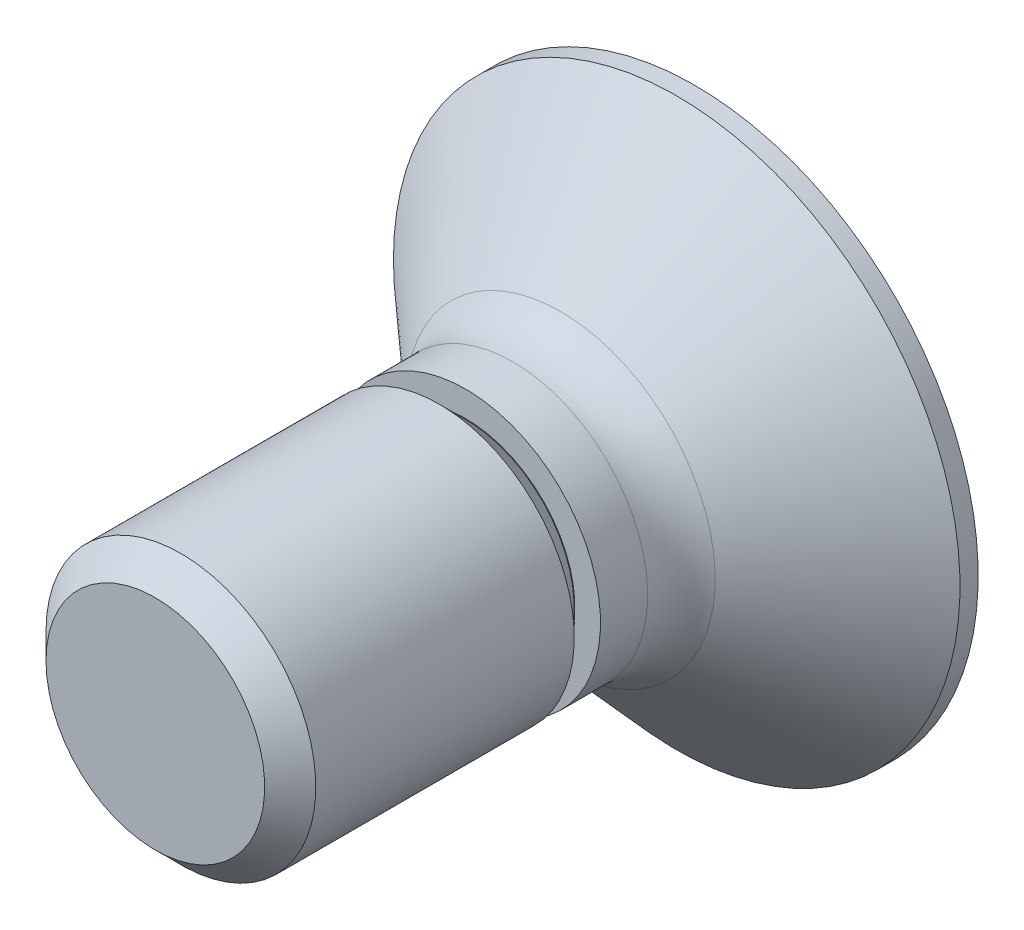
ISO-10303-21;
HEADER;
FILE_DESCRIPTION(('STEP AP214'),'2;1');
FILE_NAME('part.step','',(''),(''),'','','');
FILE_SCHEMA(('AUTOMOTIVE_DESIGN { 1 0 10303 214 1 1 1 1 }'));
ENDSEC;
DATA;
#1=APPLICATION_CONTEXT('core data for automotive mechanical design processes');
#2=APPLICATION_PROTOCOL_DEFINITION('international standard','automotive_design',2000,#1);
#3=PRODUCT_CONTEXT('',#1,'mechanical');
#4=PRODUCT('Part','Part','',(#3));
#5=PRODUCT_RELATED_PRODUCT_CATEGORY('part','',(#4));
#6=PRODUCT_DEFINITION_FORMATION('','',#4);
#7=PRODUCT_DEFINITION_CONTEXT('part definition',#1,'design');
#8=PRODUCT_DEFINITION('design','',#6,#7);
#9=PRODUCT_DEFINITION_SHAPE('','',#8);
#10=(LENGTH_UNIT() NAMED_UNIT(*) SI_UNIT(.MILLI.,.METRE.));
#11=(NAMED_UNIT(*) PLANE_ANGLE_UNIT() SI_UNIT($,.RADIAN.));
#12=(NAMED_UNIT(*) SI_UNIT($,.STERADIAN.) SOLID_ANGLE_UNIT());
#13=UNCERTAINTY_MEASURE_WITH_UNIT(LENGTH_MEASURE(1.E-05),#10,'distance_accuracy_value','');
#14=(GEOMETRIC_REPRESENTATION_CONTEXT(3) GLOBAL_UNCERTAINTY_ASSIGNED_CONTEXT((#13)) GLOBAL_UNIT_ASSIGNED_CONTEXT((#10,
#11,#12)) REPRESENTATION_CONTEXT('',''));
#15=CARTESIAN_POINT('',(0.,0.,0.));
#16=DIRECTION('',(0.,0.,1.));
#17=DIRECTION('',(1.,0.,0.));
#18=AXIS2_PLACEMENT_3D('',#15,#16,#17);
#19=CARTESIAN_POINT('',(0.,4.2,0.));
#20=DIRECTION('',(0.,0.,1.));
#21=DIRECTION('',(1.,0.,0.));
#22=AXIS2_PLACEMENT_3D('',#19,#20,#21);
#23=PLANE('',#22);
#24=CARTESIAN_POINT('',(0.,0.,0.));
#25=DIRECTION('',(0.,0.,-1.));
#26=DIRECTION('',(-1.,0.,0.));
#27=AXIS2_PLACEMENT_3D('',#24,#25,#26);
#28=CIRCLE('',#27,4.2);
#29=CARTESIAN_POINT('',(-4.2,0.,0.));
#30=VERTEX_POINT('',#29);
#31=EDGE_CURVE('E210',#30,#30,#28,.T.);
#32=ORIENTED_EDGE('',*,*,#31,.T.);
#33=EDGE_LOOP('',(#32));
#34=FACE_BOUND('',#33,.T.);
#35=DIRECTION('',(0.422618261740699,0.90630778703665,0.));
#36=VECTOR('',#35,1.);
#37=CARTESIAN_POINT('',(0.383333333333334,-2.3,0.));
#38=LINE('',#37,#36);
#39=CARTESIAN_POINT('',(0.383333333333334,-2.3,0.));
#40=VERTEX_POINT('',#39);
#41=CARTESIAN_POINT('',(0.992861858828223,-0.992861858828222,0.));
#42=VERTEX_POINT('',#41);
#43=EDGE_CURVE('E32',#40,#42,#38,.T.);
#44=ORIENTED_EDGE('',*,*,#43,.T.);
#45=DIRECTION('',(0.90630778703665,0.422618261740699,0.));
#46=VECTOR('',#45,1.);
#47=CARTESIAN_POINT('',(0.992861858828223,-0.992861858828222,0.));
#48=LINE('',#47,#46);
#49=CARTESIAN_POINT('',(2.3,-0.383333333333334,0.));
#50=VERTEX_POINT('',#49);
#51=EDGE_CURVE('E87',#42,#50,#48,.T.);
#52=ORIENTED_EDGE('',*,*,#51,.T.);
#53=DIRECTION('',(0.,1.,0.));
#54=VECTOR('',#53,1.);
#55=CARTESIAN_POINT('',(2.3,-0.383333333333334,0.));
#56=LINE('',#55,#54);
#57=CARTESIAN_POINT('',(2.3,0.383333333333334,0.));
#58=VERTEX_POINT('',#57);
#59=EDGE_CURVE('E171',#50,#58,#56,.T.);
#60=ORIENTED_EDGE('',*,*,#59,.T.);
#61=DIRECTION('',(-0.90630778703665,0.422618261740699,0.));
#62=VECTOR('',#61,1.);
#63=CARTESIAN_POINT('',(2.3,0.383333333333334,0.));
#64=LINE('',#63,#62);
#65=CARTESIAN_POINT('',(0.992861858828224,0.992861858828222,0.));
#66=VERTEX_POINT('',#65);
#67=EDGE_CURVE('E167',#58,#66,#64,.T.);
#68=ORIENTED_EDGE('',*,*,#67,.T.);
#69=DIRECTION('',(-0.4226182617407,0.90630778703665,0.));
#70=VECTOR('',#69,1.);
#71=CARTESIAN_POINT('',(0.992861858828224,0.992861858828222,0.));
#72=LINE('',#71,#70);
#73=CARTESIAN_POINT('',(0.383333333333334,2.3,0.));
#74=VERTEX_POINT('',#73);
#75=EDGE_CURVE('E163',#66,#74,#72,.T.);
#76=ORIENTED_EDGE('',*,*,#75,.T.);
#77=DIRECTION('',(-1.,0.,0.));
#78=VECTOR('',#77,1.);
#79=CARTESIAN_POINT('',(0.383333333333334,2.3,0.));
#80=LINE('',#79,#78);
#81=CARTESIAN_POINT('',(-0.383333333333333,2.3,0.));
#82=VERTEX_POINT('',#81);
#83=EDGE_CURVE('E159',#74,#82,#80,.T.);
#84=ORIENTED_EDGE('',*,*,#83,.T.);
#85=DIRECTION('',(-0.422618261740699,-0.90630778703665,0.));
#86=VECTOR('',#85,1.);
#87=CARTESIAN_POINT('',(-0.383333333333333,2.3,0.));
#88=LINE('',#87,#86);
#89=CARTESIAN_POINT('',(-0.992861858828222,0.992861858828223,0.));
#90=VERTEX_POINT('',#89);
#91=EDGE_CURVE('E155',#82,#90,#88,.T.);
#92=ORIENTED_EDGE('',*,*,#91,.T.);
#93=DIRECTION('',(-0.90630778703665,-0.422618261740699,0.));
#94=VECTOR('',#93,1.);
#95=CARTESIAN_POINT('',(-0.992861858828222,0.992861858828223,0.));
#96=LINE('',#95,#94);
#97=CARTESIAN_POINT('',(-2.3,0.383333333333334,0.));
#98=VERTEX_POINT('',#97);
#99=EDGE_CURVE('E151',#90,#98,#96,.T.);
#100=ORIENTED_EDGE('',*,*,#99,.T.);
#101=DIRECTION('',(0.,-1.,0.));
#102=VECTOR('',#101,1.);
#103=CARTESIAN_POINT('',(-2.3,0.383333333333334,0.));
#104=LINE('',#103,#102);
#105=CARTESIAN_POINT('',(-2.3,-0.383333333333333,0.));
#106=VERTEX_POINT('',#105);
#107=EDGE_CURVE('E146',#98,#106,#104,.T.);
#108=ORIENTED_EDGE('',*,*,#107,.T.);
#109=DIRECTION('',(0.90630778703665,-0.422618261740699,0.));
#110=VECTOR('',#109,1.);
#111=CARTESIAN_POINT('',(-2.3,-0.383333333333333,0.));
#112=LINE('',#111,#110);
#113=CARTESIAN_POINT('',(-0.992861858828224,-0.992861858828222,0.));
#114=VERTEX_POINT('',#113);
#115=EDGE_CURVE('E137',#106,#114,#112,.T.);
#116=ORIENTED_EDGE('',*,*,#115,.T.);
#117=DIRECTION('',(0.422618261740699,-0.90630778703665,0.));
#118=VECTOR('',#117,1.);
#119=CARTESIAN_POINT('',(-0.992861858828224,-0.992861858828222,0.));
#120=LINE('',#119,#118);
#121=CARTESIAN_POINT('',(-0.383333333333334,-2.3,0.));
#122=VERTEX_POINT('',#121);
#123=EDGE_CURVE('E120',#114,#122,#120,.T.);
#124=ORIENTED_EDGE('',*,*,#123,.T.);
#125=DIRECTION('',(1.,0.,0.));
#126=VECTOR('',#125,1.);
#127=CARTESIAN_POINT('',(-0.383333333333334,-2.3,0.));
#128=LINE('',#127,#126);
#129=EDGE_CURVE('E129',#122,#40,#128,.T.);
#130=ORIENTED_EDGE('',*,*,#129,.T.);
#131=EDGE_LOOP('',(#44,#52,#60,#68,#76,#84,#92,#100,#108,#116,#124,#130));
#132=FACE_BOUND('',#131,.T.);
#133=ADVANCED_FACE('F16',(#34,#132),#23,.F.);
#134=CARTESIAN_POINT('',(0.,0.,8.));
#135=DIRECTION('',(0.,0.,-1.));
#136=DIRECTION('',(-1.,0.,0.));
#137=AXIS2_PLACEMENT_3D('',#134,#135,#136);
#138=PLANE('',#137);
#139=CARTESIAN_POINT('',(0.,0.,8.));
#140=DIRECTION('',(0.,0.,-1.));
#141=DIRECTION('',(-1.,0.,0.));
#142=AXIS2_PLACEMENT_3D('',#139,#140,#141);
#143=CIRCLE('',#142,1.621125);
#144=CARTESIAN_POINT('',(-1.621125,0.,8.));
#145=VERTEX_POINT('',#144);
#146=EDGE_CURVE('E10',#145,#145,#143,.T.);
#147=ORIENTED_EDGE('',*,*,#146,.F.);
#148=EDGE_LOOP('',(#147));
#149=FACE_BOUND('',#148,.T.);
#150=ADVANCED_FACE('F18',(#149),#138,.F.);
#151=CARTESIAN_POINT('',(0.,0.,8.));
#152=DIRECTION('',(0.,0.,-1.));
#153=DIRECTION('',(-1.,0.,0.));
#154=AXIS2_PLACEMENT_3D('',#151,#152,#153);
#155=CONICAL_SURFACE('',#154,1.621125,0.785398163397449);
#156=CARTESIAN_POINT('',(0.,0.,7.621125));
#157=DIRECTION('',(0.,0.,-1.));
#158=DIRECTION('',(-1.,0.,0.));
#159=AXIS2_PLACEMENT_3D('',#156,#157,#158);
#160=CIRCLE('',#159,2.);
#161=CARTESIAN_POINT('',(-2.,0.,7.621125));
#162=VERTEX_POINT('',#161);
#163=EDGE_CURVE('E25',#162,#162,#160,.T.);
#164=ORIENTED_EDGE('',*,*,#163,.F.);
#165=EDGE_LOOP('',(#164));
#166=FACE_BOUND('',#165,.T.);
#167=ORIENTED_EDGE('',*,*,#146,.T.);
#168=EDGE_LOOP('',(#167));
#169=FACE_BOUND('',#168,.T.);
#170=ADVANCED_FACE('F282',(#166,#169),#155,.T.);
#171=CARTESIAN_POINT('',(0.,0.,0.));
#172=DIRECTION('',(0.,0.,-1.));
#173=DIRECTION('',(-1.,0.,0.));
#174=AXIS2_PLACEMENT_3D('',#171,#172,#173);
#175=CYLINDRICAL_SURFACE('',#174,2.);
#176=CARTESIAN_POINT('',(0.,0.,3.788875));
#177=DIRECTION('',(0.,0.,-1.));
#178=DIRECTION('',(-1.,0.,0.));
#179=AXIS2_PLACEMENT_3D('',#176,#177,#178);
#180=CIRCLE('',#179,2.);
#181=CARTESIAN_POINT('',(-2.,0.,3.788875));
#182=VERTEX_POINT('',#181);
#183=EDGE_CURVE('E269',#182,#182,#180,.T.);
#184=ORIENTED_EDGE('',*,*,#183,.F.);
#185=EDGE_LOOP('',(#184));
#186=FACE_BOUND('',#185,.T.);
#187=ORIENTED_EDGE('',*,*,#163,.T.);
#188=EDGE_LOOP('',(#187));
#189=FACE_BOUND('',#188,.T.);
#190=ADVANCED_FACE('F280',(#186,#189),#175,.T.);
#191=CARTESIAN_POINT('',(0.,0.,3.788875));
#192=DIRECTION('',(0.,0.,1.));
#193=DIRECTION('',(1.,0.,0.));
#194=AXIS2_PLACEMENT_3D('',#191,#192,#193);
#195=CONICAL_SURFACE('',#194,2.,0.785398163397448);
#196=CARTESIAN_POINT('',(0.,0.,3.41));
#197=DIRECTION('',(0.,0.,-1.));
#198=DIRECTION('',(-1.,0.,0.));
#199=AXIS2_PLACEMENT_3D('',#196,#197,#198);
#200=CIRCLE('',#199,1.621125);
#201=CARTESIAN_POINT('',(-1.621125,0.,3.41));
#202=VERTEX_POINT('',#201);
#203=EDGE_CURVE('E265',#202,#202,#200,.T.);
#204=ORIENTED_EDGE('',*,*,#203,.F.);
#205=EDGE_LOOP('',(#204));
#206=FACE_BOUND('',#205,.T.);
#207=ORIENTED_EDGE('',*,*,#183,.T.);
#208=EDGE_LOOP('',(#207));
#209=FACE_BOUND('',#208,.T.);
#210=ADVANCED_FACE('F323',(#206,#209),#195,.T.);
#211=CARTESIAN_POINT('',(0.,0.,0.));
#212=DIRECTION('',(0.,0.,-1.));
#213=DIRECTION('',(-1.,0.,0.));
#214=AXIS2_PLACEMENT_3D('',#211,#212,#213);
#215=CYLINDRICAL_SURFACE('',#214,1.621125);
#216=CARTESIAN_POINT('',(0.,0.,3.4));
#217=DIRECTION('',(0.,0.,-1.));
#218=DIRECTION('',(-1.,0.,0.));
#219=AXIS2_PLACEMENT_3D('',#216,#217,#218);
#220=CIRCLE('',#219,1.621125);
#221=CARTESIAN_POINT('',(-1.621125,0.,3.4));
#222=VERTEX_POINT('',#221);
#223=EDGE_CURVE('E261',#222,#222,#220,.T.);
#224=ORIENTED_EDGE('',*,*,#223,.F.);
#225=EDGE_LOOP('',(#224));
#226=FACE_BOUND('',#225,.T.);
#227=ORIENTED_EDGE('',*,*,#203,.T.);
#228=EDGE_LOOP('',(#227));
#229=FACE_BOUND('',#228,.T.);
#230=ADVANCED_FACE('F319',(#226,#229),#215,.T.);
#231=CARTESIAN_POINT('',(0.,1.621125,3.4));
#232=DIRECTION('',(0.,0.,-1.));
#233=DIRECTION('',(-1.,0.,0.));
#234=AXIS2_PLACEMENT_3D('',#231,#232,#233);
#235=PLANE('',#234);
#236=CARTESIAN_POINT('',(0.,0.,3.4));
#237=DIRECTION('',(0.,0.,-1.));
#238=DIRECTION('',(-1.,0.,0.));
#239=AXIS2_PLACEMENT_3D('',#236,#237,#238);
#240=CIRCLE('',#239,2.);
#241=CARTESIAN_POINT('',(-2.,0.,3.4));
#242=VERTEX_POINT('',#241);
#243=EDGE_CURVE('E257',#242,#242,#240,.T.);
#244=ORIENTED_EDGE('',*,*,#243,.F.);
#245=EDGE_LOOP('',(#244));
#246=FACE_BOUND('',#245,.T.);
#247=ORIENTED_EDGE('',*,*,#223,.T.);
#248=EDGE_LOOP('',(#247));
#249=FACE_BOUND('',#248,.T.);
#250=ADVANCED_FACE('F315',(#246,#249),#235,.F.);
#251=CARTESIAN_POINT('',(0.,0.,0.));
#252=DIRECTION('',(0.,0.,-1.));
#253=DIRECTION('',(-1.,0.,0.));
#254=AXIS2_PLACEMENT_3D('',#251,#252,#253);
#255=CYLINDRICAL_SURFACE('',#254,2.);
#256=CARTESIAN_POINT('',(0.,0.,2.7));
#257=DIRECTION('',(0.,0.,-1.));
#258=DIRECTION('',(-1.,0.,0.));
#259=AXIS2_PLACEMENT_3D('',#256,#257,#258);
#260=CIRCLE('',#259,2.);
#261=CARTESIAN_POINT('',(-2.,0.,2.7));
#262=VERTEX_POINT('',#261);
#263=EDGE_CURVE('E254',#262,#262,#260,.T.);
#264=ORIENTED_EDGE('',*,*,#263,.F.);
#265=EDGE_LOOP('',(#264));
#266=FACE_BOUND('',#265,.T.);
#267=ORIENTED_EDGE('',*,*,#243,.T.);
#268=EDGE_LOOP('',(#267));
#269=FACE_BOUND('',#268,.T.);
#270=ADVANCED_FACE('F311',(#266,#269),#255,.T.);
#271=CARTESIAN_POINT('',(0.,0.,2.7));
#272=DIRECTION('',(0.,0.,-1.));
#273=DIRECTION('',(-1.,0.,0.));
#274=AXIS2_PLACEMENT_3D('',#271,#272,#273);
#275=TOROIDAL_SURFACE('',#274,3.,1.);
#276=ORIENTED_EDGE('',*,*,#263,.T.);
#277=EDGE_LOOP('',(#276));
#278=FACE_BOUND('',#277,.T.);
#279=CARTESIAN_POINT('',(0.,0.,1.99289321881346));
#280=DIRECTION('',(0.,0.,-1.));
#281=DIRECTION('',(-1.,0.,0.));
#282=AXIS2_PLACEMENT_3D('',#279,#280,#281);
#283=CIRCLE('',#282,2.29289321881346);
#284=CARTESIAN_POINT('',(-2.29289321881346,0.,1.99289321881346));
#285=VERTEX_POINT('',#284);
#286=EDGE_CURVE('E250',#285,#285,#283,.T.);
#287=ORIENTED_EDGE('',*,*,#286,.F.);
#288=EDGE_LOOP('',(#287));
#289=FACE_BOUND('',#288,.T.);
#290=ADVANCED_FACE('F307',(#278,#289),#275,.F.);
#291=CARTESIAN_POINT('',(0.,0.,1.99289321881346));
#292=DIRECTION('',(0.,0.,-1.));
#293=DIRECTION('',(-1.,0.,0.));
#294=AXIS2_PLACEMENT_3D('',#291,#292,#293);
#295=CONICAL_SURFACE('',#294,2.29289321881346,0.836102204840456);
#296=CARTESIAN_POINT('',(0.,0.,0.27));
#297=DIRECTION('',(0.,0.,-1.));
#298=DIRECTION('',(-1.,0.,0.));
#299=AXIS2_PLACEMENT_3D('',#296,#297,#298);
#300=CIRCLE('',#299,4.2);
#301=CARTESIAN_POINT('',(-4.2,0.,0.27));
#302=VERTEX_POINT('',#301);
#303=EDGE_CURVE('E246',#302,#302,#300,.T.);
#304=ORIENTED_EDGE('',*,*,#303,.F.);
#305=EDGE_LOOP('',(#304));
#306=FACE_BOUND('',#305,.T.);
#307=ORIENTED_EDGE('',*,*,#286,.T.);
#308=EDGE_LOOP('',(#307));
#309=FACE_BOUND('',#308,.T.);
#310=ADVANCED_FACE('F303',(#306,#309),#295,.T.);
#311=CARTESIAN_POINT('',(0.,0.,0.));
#312=DIRECTION('',(0.,0.,-1.));
#313=DIRECTION('',(-1.,0.,0.));
#314=AXIS2_PLACEMENT_3D('',#311,#312,#313);
#315=CYLINDRICAL_SURFACE('',#314,4.2);
#316=ORIENTED_EDGE('',*,*,#31,.F.);
#317=EDGE_LOOP('',(#316));
#318=FACE_BOUND('',#317,.T.);
#319=ORIENTED_EDGE('',*,*,#303,.T.);
#320=EDGE_LOOP('',(#319));
#321=FACE_BOUND('',#320,.T.);
#322=ADVANCED_FACE('F300',(#318,#321),#315,.T.);
#323=CARTESIAN_POINT('',(0.383333333333334,-2.3,0.));
#324=DIRECTION('',(0.875426098065593,-0.408217893676735,0.258819045102521));
#325=DIRECTION('',(0.422618261740699,0.90630778703665,0.));
#326=AXIS2_PLACEMENT_3D('',#323,#324,#325);
#327=PLANE('',#326);
#328=ORIENTED_EDGE('',*,*,#43,.F.);
#329=DIRECTION('',(0.162689201767992,-0.255370893567974,-0.953057149569945));
#330=VECTOR('',#329,1.);
#331=CARTESIAN_POINT('',(0.383333333333334,-2.3,0.));
#332=LINE('',#331,#330);
#333=CARTESIAN_POINT('',(0.024858163332303,-1.73730669589464,2.1));
#334=VERTEX_POINT('',#333);
#335=EDGE_CURVE('E126',#334,#40,#332,.T.);
#336=ORIENTED_EDGE('',*,*,#335,.F.);
#337=DIRECTION('',(-0.422618261740699,-0.90630778703665,0.));
#338=VECTOR('',#337,1.);
#339=CARTESIAN_POINT('',(-0.126639989890734,-2.06219553392586,2.1));
#340=LINE('',#339,#338);
#341=CARTESIAN_POINT('',(0.569442282830708,-0.569442282830708,2.1));
#342=VERTEX_POINT('',#341);
#343=EDGE_CURVE('E133',#334,#342,#340,.F.);
#344=ORIENTED_EDGE('',*,*,#343,.T.);
#345=DIRECTION('',(0.193899607686987,-0.193899607686987,-0.961668281829896));
#346=VECTOR('',#345,1.);
#347=CARTESIAN_POINT('',(1.01908992791333,-1.01908992791333,-0.130081243761521));
#348=LINE('',#347,#346);
#349=EDGE_CURVE('E207',#342,#42,#348,.T.);
#350=ORIENTED_EDGE('',*,*,#349,.T.);
#351=EDGE_LOOP('',(#328,#336,#344,#350));
#352=FACE_BOUND('',#351,.T.);
#353=ADVANCED_FACE('F298',(#352),#327,.F.);
#354=CARTESIAN_POINT('',(0.992861858828223,-0.992861858828222,0.));
#355=DIRECTION('',(0.408217893676735,-0.875426098065593,0.258819045102521));
#356=DIRECTION('',(0.90630778703665,0.422618261740699,0.));
#357=AXIS2_PLACEMENT_3D('',#354,#355,#356);
#358=PLANE('',#357);
#359=ORIENTED_EDGE('',*,*,#51,.F.);
#360=ORIENTED_EDGE('',*,*,#349,.F.);
#361=DIRECTION('',(-0.90630778703665,-0.422618261740699,0.));
#362=VECTOR('',#361,1.);
#363=CARTESIAN_POINT('',(0.755057392754086,-0.482888535604155,2.1));
#364=LINE('',#363,#362);
#365=CARTESIAN_POINT('',(1.73730669589464,-0.024858163332303,2.1));
#366=VERTEX_POINT('',#365);
#367=EDGE_CURVE('E41',#342,#366,#364,.F.);
#368=ORIENTED_EDGE('',*,*,#367,.T.);
#369=DIRECTION('',(0.255370893567974,-0.162689201767992,-0.953057149569945));
#370=VECTOR('',#369,1.);
#371=CARTESIAN_POINT('',(2.3,-0.383333333333334,0.));
#372=LINE('',#371,#370);
#373=EDGE_CURVE('E204',#366,#50,#372,.T.);
#374=ORIENTED_EDGE('',*,*,#373,.T.);
#375=EDGE_LOOP('',(#359,#360,#368,#374));
#376=FACE_BOUND('',#375,.T.);
#377=ADVANCED_FACE('F374',(#376),#358,.F.);
#378=CARTESIAN_POINT('',(2.3,-0.383333333333334,0.));
#379=DIRECTION('',(0.965925826289068,0.,0.258819045102521));
#380=DIRECTION('',(0.258819045102521,0.,-0.965925826289068));
#381=AXIS2_PLACEMENT_3D('',#378,#379,#380);
#382=PLANE('',#381);
#383=ORIENTED_EDGE('',*,*,#59,.F.);
#384=ORIENTED_EDGE('',*,*,#373,.F.);
#385=DIRECTION('',(0.,-1.,0.));
#386=VECTOR('',#385,1.);
#387=CARTESIAN_POINT('',(1.73730669589464,-0.383333333333334,2.1));
#388=LINE('',#387,#386);
#389=CARTESIAN_POINT('',(1.73730669589464,0.024858163332303,2.1));
#390=VERTEX_POINT('',#389);
#391=EDGE_CURVE('E217',#366,#390,#388,.F.);
#392=ORIENTED_EDGE('',*,*,#391,.T.);
#393=DIRECTION('',(0.255370893567974,0.162689201767992,-0.953057149569945));
#394=VECTOR('',#393,1.);
#395=CARTESIAN_POINT('',(2.3,0.383333333333334,0.));
#396=LINE('',#395,#394);
#397=EDGE_CURVE('E201',#390,#58,#396,.T.);
#398=ORIENTED_EDGE('',*,*,#397,.T.);
#399=EDGE_LOOP('',(#383,#384,#392,#398));
#400=FACE_BOUND('',#399,.T.);
#401=ADVANCED_FACE('F379',(#400),#382,.F.);
#402=CARTESIAN_POINT('',(2.3,0.383333333333334,0.));
#403=DIRECTION('',(0.408217893676735,0.875426098065593,0.258819045102521));
#404=DIRECTION('',(-0.90630778703665,0.422618261740699,0.));
#405=AXIS2_PLACEMENT_3D('',#402,#403,#404);
#406=PLANE('',#405);
#407=ORIENTED_EDGE('',*,*,#67,.F.);
#408=ORIENTED_EDGE('',*,*,#397,.F.);
#409=DIRECTION('',(0.90630778703665,-0.422618261740699,0.));
#410=VECTOR('',#409,1.);
#411=CARTESIAN_POINT('',(2.06219553392586,-0.126639989890734,2.1));
#412=LINE('',#411,#410);
#413=CARTESIAN_POINT('',(0.569442282830709,0.569442282830708,2.1));
#414=VERTEX_POINT('',#413);
#415=EDGE_CURVE('E220',#390,#414,#412,.F.);
#416=ORIENTED_EDGE('',*,*,#415,.T.);
#417=DIRECTION('',(0.193899607686987,0.193899607686987,-0.961668281829896));
#418=VECTOR('',#417,1.);
#419=CARTESIAN_POINT('',(1.01908992791333,1.01908992791333,-0.130081243761521));
#420=LINE('',#419,#418);
#421=EDGE_CURVE('E198',#414,#66,#420,.T.);
#422=ORIENTED_EDGE('',*,*,#421,.T.);
#423=EDGE_LOOP('',(#407,#408,#416,#422));
#424=FACE_BOUND('',#423,.T.);
#425=ADVANCED_FACE('F384',(#424),#406,.F.);
#426=CARTESIAN_POINT('',(0.992861858828224,0.992861858828222,0.));
#427=DIRECTION('',(0.875426098065593,0.408217893676735,0.258819045102521));
#428=DIRECTION('',(-0.4226182617407,0.90630778703665,0.));
#429=AXIS2_PLACEMENT_3D('',#426,#427,#428);
#430=PLANE('',#429);
#431=ORIENTED_EDGE('',*,*,#75,.F.);
#432=ORIENTED_EDGE('',*,*,#421,.F.);
#433=DIRECTION('',(0.4226182617407,-0.90630778703665,0.));
#434=VECTOR('',#433,1.);
#435=CARTESIAN_POINT('',(0.482888535604156,0.755057392754085,2.1));
#436=LINE('',#435,#434);
#437=CARTESIAN_POINT('',(0.0248581633323035,1.73730669589464,2.1));
#438=VERTEX_POINT('',#437);
#439=EDGE_CURVE('E223',#414,#438,#436,.F.);
#440=ORIENTED_EDGE('',*,*,#439,.T.);
#441=DIRECTION('',(0.162689201767992,0.255370893567974,-0.953057149569945));
#442=VECTOR('',#441,1.);
#443=CARTESIAN_POINT('',(0.383333333333334,2.3,0.));
#444=LINE('',#443,#442);
#445=EDGE_CURVE('E195',#438,#74,#444,.T.);
#446=ORIENTED_EDGE('',*,*,#445,.T.);
#447=EDGE_LOOP('',(#431,#432,#440,#446));
#448=FACE_BOUND('',#447,.T.);
#449=ADVANCED_FACE('F391',(#448),#430,.F.);
#450=CARTESIAN_POINT('',(0.383333333333334,2.3,0.));
#451=DIRECTION('',(0.,0.965925826289068,0.258819045102521));
#452=DIRECTION('',(0.,-0.258819045102521,0.965925826289068));
#453=AXIS2_PLACEMENT_3D('',#450,#451,#452);
#454=PLANE('',#453);
#455=ORIENTED_EDGE('',*,*,#83,.F.);
#456=ORIENTED_EDGE('',*,*,#445,.F.);
#457=DIRECTION('',(1.,0.,0.));
#458=VECTOR('',#457,1.);
#459=CARTESIAN_POINT('',(0.383333333333334,1.73730669589464,2.1));
#460=LINE('',#459,#458);
#461=CARTESIAN_POINT('',(-0.0248581633323028,1.73730669589464,2.1));
#462=VERTEX_POINT('',#461);
#463=EDGE_CURVE('E226',#438,#462,#460,.F.);
#464=ORIENTED_EDGE('',*,*,#463,.T.);
#465=DIRECTION('',(-0.162689201767992,0.255370893567974,-0.953057149569945));
#466=VECTOR('',#465,1.);
#467=CARTESIAN_POINT('',(-0.383333333333333,2.3,0.));
#468=LINE('',#467,#466);
#469=EDGE_CURVE('E192',#462,#82,#468,.T.);
#470=ORIENTED_EDGE('',*,*,#469,.T.);
#471=EDGE_LOOP('',(#455,#456,#464,#470));
#472=FACE_BOUND('',#471,.T.);
#473=ADVANCED_FACE('F398',(#472),#454,.F.);
#474=CARTESIAN_POINT('',(-0.383333333333333,2.3,0.));
#475=DIRECTION('',(-0.875426098065593,0.408217893676735,0.258819045102521));
#476=DIRECTION('',(-0.422618261740699,-0.90630778703665,0.));
#477=AXIS2_PLACEMENT_3D('',#474,#475,#476);
#478=PLANE('',#477);
#479=ORIENTED_EDGE('',*,*,#91,.F.);
#480=ORIENTED_EDGE('',*,*,#469,.F.);
#481=DIRECTION('',(0.422618261740699,0.90630778703665,0.));
#482=VECTOR('',#481,1.);
#483=CARTESIAN_POINT('',(0.126639989890734,2.06219553392586,2.1));
#484=LINE('',#483,#482);
#485=CARTESIAN_POINT('',(-0.569442282830708,0.569442282830709,2.1));
#486=VERTEX_POINT('',#485);
#487=EDGE_CURVE('E229',#462,#486,#484,.F.);
#488=ORIENTED_EDGE('',*,*,#487,.T.);
#489=DIRECTION('',(-0.193899607686987,0.193899607686987,-0.961668281829896));
#490=VECTOR('',#489,1.);
#491=CARTESIAN_POINT('',(-1.01908992791333,1.01908992791333,-0.130081243761521));
#492=LINE('',#491,#490);
#493=EDGE_CURVE('E189',#486,#90,#492,.T.);
#494=ORIENTED_EDGE('',*,*,#493,.T.);
#495=EDGE_LOOP('',(#479,#480,#488,#494));
#496=FACE_BOUND('',#495,.T.);
#497=ADVANCED_FACE('F406',(#496),#478,.F.);
#498=CARTESIAN_POINT('',(-0.992861858828222,0.992861858828223,0.));
#499=DIRECTION('',(-0.408217893676735,0.875426098065593,0.258819045102521));
#500=DIRECTION('',(-0.90630778703665,-0.422618261740699,0.));
#501=AXIS2_PLACEMENT_3D('',#498,#499,#500);
#502=PLANE('',#501);
#503=ORIENTED_EDGE('',*,*,#99,.F.);
#504=ORIENTED_EDGE('',*,*,#493,.F.);
#505=DIRECTION('',(0.90630778703665,0.422618261740699,0.));
#506=VECTOR('',#505,1.);
#507=CARTESIAN_POINT('',(-0.755057392754085,0.482888535604156,2.1));
#508=LINE('',#507,#506);
#509=CARTESIAN_POINT('',(-1.73730669589464,0.0248581633323036,2.1));
#510=VERTEX_POINT('',#509);
#511=EDGE_CURVE('E232',#486,#510,#508,.F.);
#512=ORIENTED_EDGE('',*,*,#511,.T.);
#513=DIRECTION('',(-0.255370893567974,0.162689201767992,-0.953057149569945));
#514=VECTOR('',#513,1.);
#515=CARTESIAN_POINT('',(-2.3,0.383333333333334,0.));
#516=LINE('',#515,#514);
#517=EDGE_CURVE('E186',#510,#98,#516,.T.);
#518=ORIENTED_EDGE('',*,*,#517,.T.);
#519=EDGE_LOOP('',(#503,#504,#512,#518));
#520=FACE_BOUND('',#519,.T.);
#521=ADVANCED_FACE('F414',(#520),#502,.F.);
#522=CARTESIAN_POINT('',(-2.3,0.383333333333334,0.));
#523=DIRECTION('',(-0.965925826289068,0.,0.258819045102521));
#524=DIRECTION('',(0.258819045102521,0.,0.965925826289068));
#525=AXIS2_PLACEMENT_3D('',#522,#523,#524);
#526=PLANE('',#525);
#527=ORIENTED_EDGE('',*,*,#107,.F.);
#528=ORIENTED_EDGE('',*,*,#517,.F.);
#529=DIRECTION('',(0.,1.,0.));
#530=VECTOR('',#529,1.);
#531=CARTESIAN_POINT('',(-1.73730669589464,0.383333333333334,2.1));
#532=LINE('',#531,#530);
#533=CARTESIAN_POINT('',(-1.73730669589464,-0.0248581633323025,2.1));
#534=VERTEX_POINT('',#533);
#535=EDGE_CURVE('E235',#510,#534,#532,.F.);
#536=ORIENTED_EDGE('',*,*,#535,.T.);
#537=DIRECTION('',(-0.255370893567974,-0.162689201767992,-0.953057149569945));
#538=VECTOR('',#537,1.);
#539=CARTESIAN_POINT('',(-2.3,-0.383333333333333,0.));
#540=LINE('',#539,#538);
#541=EDGE_CURVE('E183',#534,#106,#540,.T.);
#542=ORIENTED_EDGE('',*,*,#541,.T.);
#543=EDGE_LOOP('',(#527,#528,#536,#542));
#544=FACE_BOUND('',#543,.T.);
#545=ADVANCED_FACE('F422',(#544),#526,.F.);
#546=CARTESIAN_POINT('',(-2.3,-0.383333333333333,0.));
#547=DIRECTION('',(-0.408217893676735,-0.875426098065593,0.258819045102521));
#548=DIRECTION('',(0.90630778703665,-0.422618261740699,0.));
#549=AXIS2_PLACEMENT_3D('',#546,#547,#548);
#550=PLANE('',#549);
#551=ORIENTED_EDGE('',*,*,#115,.F.);
#552=ORIENTED_EDGE('',*,*,#541,.F.);
#553=DIRECTION('',(-0.90630778703665,0.422618261740699,0.));
#554=VECTOR('',#553,1.);
#555=CARTESIAN_POINT('',(-2.06219553392586,0.126639989890734,2.1));
#556=LINE('',#555,#554);
#557=CARTESIAN_POINT('',(-0.569442282830709,-0.569442282830708,2.1));
#558=VERTEX_POINT('',#557);
#559=EDGE_CURVE('E238',#534,#558,#556,.F.);
#560=ORIENTED_EDGE('',*,*,#559,.T.);
#561=DIRECTION('',(-0.193899607686987,-0.193899607686987,-0.961668281829896));
#562=VECTOR('',#561,1.);
#563=CARTESIAN_POINT('',(-1.01908992791333,-1.01908992791333,-0.130081243761521));
#564=LINE('',#563,#562);
#565=EDGE_CURVE('E125',#558,#114,#564,.T.);
#566=ORIENTED_EDGE('',*,*,#565,.T.);
#567=EDGE_LOOP('',(#551,#552,#560,#566));
#568=FACE_BOUND('',#567,.T.);
#569=ADVANCED_FACE('F430',(#568),#550,.F.);
#570=CARTESIAN_POINT('',(-0.992861858828224,-0.992861858828222,0.));
#571=DIRECTION('',(-0.875426098065593,-0.408217893676735,0.258819045102521));
#572=DIRECTION('',(0.4226182617407,-0.90630778703665,0.));
#573=AXIS2_PLACEMENT_3D('',#570,#571,#572);
#574=PLANE('',#573);
#575=ORIENTED_EDGE('',*,*,#123,.F.);
#576=ORIENTED_EDGE('',*,*,#565,.F.);
#577=DIRECTION('',(-0.4226182617407,0.90630778703665,0.));
#578=VECTOR('',#577,1.);
#579=CARTESIAN_POINT('',(-0.482888535604156,-0.755057392754085,2.1));
#580=LINE('',#579,#578);
#581=CARTESIAN_POINT('',(-0.0248581633323032,-1.73730669589464,2.1));
#582=VERTEX_POINT('',#581);
#583=EDGE_CURVE('E78',#558,#582,#580,.F.);
#584=ORIENTED_EDGE('',*,*,#583,.T.);
#585=DIRECTION('',(-0.162689201767992,-0.255370893567974,-0.953057149569945));
#586=VECTOR('',#585,1.);
#587=CARTESIAN_POINT('',(-0.383333333333334,-2.3,0.));
#588=LINE('',#587,#586);
#589=EDGE_CURVE('E116',#582,#122,#588,.T.);
#590=ORIENTED_EDGE('',*,*,#589,.T.);
#591=EDGE_LOOP('',(#575,#576,#584,#590));
#592=FACE_BOUND('',#591,.T.);
#593=ADVANCED_FACE('F118',(#592),#574,.F.);
#594=CARTESIAN_POINT('',(-0.383333333333334,-2.3,0.));
#595=DIRECTION('',(0.,-0.965925826289068,0.258819045102521));
#596=DIRECTION('',(0.,-0.258819045102521,-0.965925826289068));
#597=AXIS2_PLACEMENT_3D('',#594,#595,#596);
#598=PLANE('',#597);
#599=ORIENTED_EDGE('',*,*,#129,.F.);
#600=ORIENTED_EDGE('',*,*,#589,.F.);
#601=DIRECTION('',(-1.,0.,0.));
#602=VECTOR('',#601,1.);
#603=CARTESIAN_POINT('',(-0.383333333333334,-1.73730669589464,2.1));
#604=LINE('',#603,#602);
#605=EDGE_CURVE('E179',#582,#334,#604,.F.);
#606=ORIENTED_EDGE('',*,*,#605,.T.);
#607=ORIENTED_EDGE('',*,*,#335,.T.);
#608=EDGE_LOOP('',(#599,#600,#606,#607));
#609=FACE_BOUND('',#608,.T.);
#610=ADVANCED_FACE('F130',(#609),#598,.F.);
#611=CARTESIAN_POINT('',(1.75343816856836,0.638199300985128,2.1));
#612=DIRECTION('',(0.,0.,1.));
#613=DIRECTION('',(1.,0.,0.));
#614=AXIS2_PLACEMENT_3D('',#611,#612,#613);
#615=PLANE('',#614);
#616=ORIENTED_EDGE('',*,*,#343,.F.);
#617=ORIENTED_EDGE('',*,*,#605,.F.);
#618=ORIENTED_EDGE('',*,*,#583,.F.);
#619=ORIENTED_EDGE('',*,*,#559,.F.);
#620=ORIENTED_EDGE('',*,*,#535,.F.);
#621=ORIENTED_EDGE('',*,*,#511,.F.);
#622=ORIENTED_EDGE('',*,*,#487,.F.);
#623=ORIENTED_EDGE('',*,*,#463,.F.);
#624=ORIENTED_EDGE('',*,*,#439,.F.);
#625=ORIENTED_EDGE('',*,*,#415,.F.);
#626=ORIENTED_EDGE('',*,*,#391,.F.);
#627=ORIENTED_EDGE('',*,*,#367,.F.);
#628=EDGE_LOOP('',(#616,#617,#618,#619,#620,#621,#622,#623,#624,#625,#626,#627));
#629=FACE_BOUND('',#628,.T.);
#630=ADVANCED_FACE('F450',(#629),#615,.F.);
#631=CLOSED_SHELL('',(#133,#150,#170,#190,#210,#230,#250,#270,#290,#310,#322,#353,#377,#401,
#425,#449,#473,#497,#521,#545,#569,#593,#610,#630));
#632=MANIFOLD_SOLID_BREP('B1',#631);
#633=ADVANCED_BREP_SHAPE_REPRESENTATION('',(#18,#632),#14);
#634=SHAPE_DEFINITION_REPRESENTATION(#9,#633);
ENDSEC;
END-ISO-10303-21;
